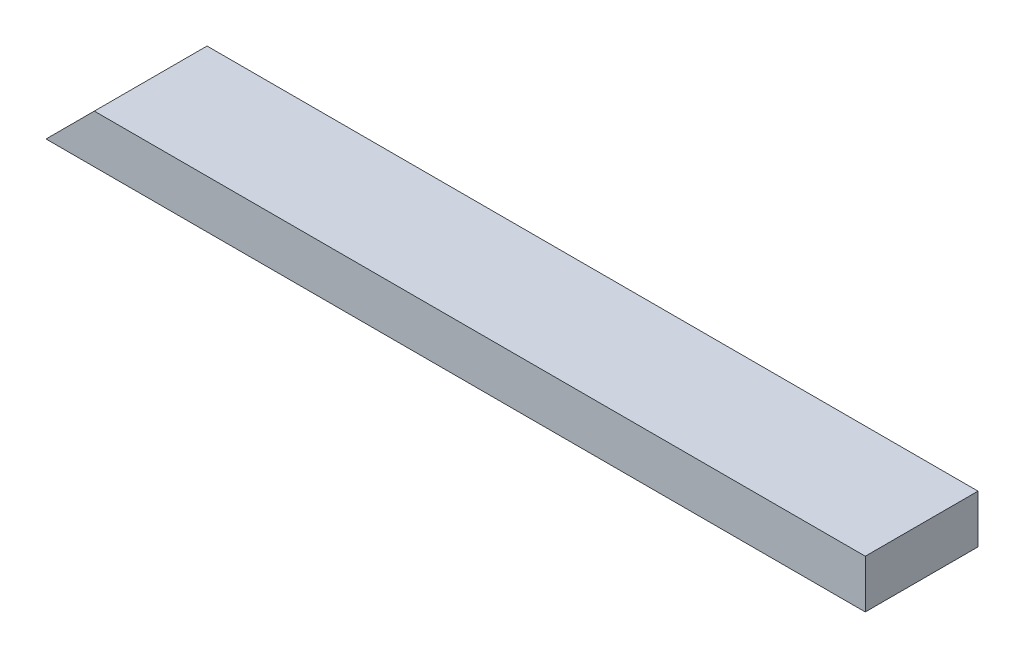
ISO-10303-21;
HEADER;
FILE_DESCRIPTION(('STEP AP214'),'2;1');
FILE_NAME('part.step','',(''),(''),'','','');
FILE_SCHEMA(('AUTOMOTIVE_DESIGN { 1 0 10303 214 1 1 1 1 }'));
ENDSEC;
DATA;
#1=APPLICATION_CONTEXT('core data for automotive mechanical design processes');
#2=APPLICATION_PROTOCOL_DEFINITION('international standard','automotive_design',2000,#1);
#3=PRODUCT_CONTEXT('',#1,'mechanical');
#4=PRODUCT('Part','Part','',(#3));
#5=PRODUCT_RELATED_PRODUCT_CATEGORY('part','',(#4));
#6=PRODUCT_DEFINITION_FORMATION('','',#4);
#7=PRODUCT_DEFINITION_CONTEXT('part definition',#1,'design');
#8=PRODUCT_DEFINITION('design','',#6,#7);
#9=PRODUCT_DEFINITION_SHAPE('','',#8);
#10=(LENGTH_UNIT() NAMED_UNIT(*) SI_UNIT(.MILLI.,.METRE.));
#11=(NAMED_UNIT(*) PLANE_ANGLE_UNIT() SI_UNIT($,.RADIAN.));
#12=(NAMED_UNIT(*) SI_UNIT($,.STERADIAN.) SOLID_ANGLE_UNIT());
#13=UNCERTAINTY_MEASURE_WITH_UNIT(LENGTH_MEASURE(1.E-05),#10,'distance_accuracy_value','');
#14=(GEOMETRIC_REPRESENTATION_CONTEXT(3) GLOBAL_UNCERTAINTY_ASSIGNED_CONTEXT((#13)) GLOBAL_UNIT_ASSIGNED_CONTEXT((#10,
#11,#12)) REPRESENTATION_CONTEXT('',''));
#15=CARTESIAN_POINT('',(0.,0.,0.));
#16=DIRECTION('',(0.,0.,1.));
#17=DIRECTION('',(1.,0.,0.));
#18=AXIS2_PLACEMENT_3D('',#15,#16,#17);
#19=CARTESIAN_POINT('',(0.,38.1,0.));
#20=DIRECTION('',(0.,0.,-1.));
#21=DIRECTION('',(-1.,0.,0.));
#22=AXIS2_PLACEMENT_3D('',#19,#20,#21);
#23=PLANE('',#22);
#24=DIRECTION('',(1.,0.,0.));
#25=VECTOR('',#24,1.);
#26=CARTESIAN_POINT('',(0.,38.1,0.));
#27=LINE('',#26,#25);
#28=CARTESIAN_POINT('',(38.1,38.1,0.));
#29=VERTEX_POINT('',#28);
#30=CARTESIAN_POINT('',(646.1125,38.1,0.));
#31=VERTEX_POINT('',#30);
#32=EDGE_CURVE('E93',#29,#31,#27,.T.);
#33=ORIENTED_EDGE('',*,*,#32,.F.);
#34=DIRECTION('',(0.707106781186547,0.707106781186547,0.));
#35=VECTOR('',#34,1.);
#36=CARTESIAN_POINT('',(0.,0.,0.));
#37=LINE('',#36,#35);
#38=CARTESIAN_POINT('',(0.,0.,0.));
#39=VERTEX_POINT('',#38);
#40=EDGE_CURVE('E87',#39,#29,#37,.T.);
#41=ORIENTED_EDGE('',*,*,#40,.F.);
#42=DIRECTION('',(1.,0.,0.));
#43=VECTOR('',#42,1.);
#44=CARTESIAN_POINT('',(0.,0.,0.));
#45=LINE('',#44,#43);
#46=CARTESIAN_POINT('',(646.1125,0.,0.));
#47=VERTEX_POINT('',#46);
#48=EDGE_CURVE('E97',#39,#47,#45,.T.);
#49=ORIENTED_EDGE('',*,*,#48,.T.);
#50=DIRECTION('',(0.,-1.,0.));
#51=VECTOR('',#50,1.);
#52=CARTESIAN_POINT('',(646.1125,38.1,0.));
#53=LINE('',#52,#51);
#54=EDGE_CURVE('E11',#31,#47,#53,.T.);
#55=ORIENTED_EDGE('',*,*,#54,.F.);
#56=EDGE_LOOP('',(#33,#41,#49,#55));
#57=FACE_BOUND('',#56,.T.);
#58=ADVANCED_FACE('F40',(#57),#23,.F.);
#59=CARTESIAN_POINT('',(646.1125,38.1,0.));
#60=DIRECTION('',(-1.,0.,0.));
#61=DIRECTION('',(0.,0.,1.));
#62=AXIS2_PLACEMENT_3D('',#59,#60,#61);
#63=PLANE('',#62);
#64=DIRECTION('',(0.,0.,-1.));
#65=VECTOR('',#64,1.);
#66=CARTESIAN_POINT('',(646.1125,0.,0.));
#67=LINE('',#66,#65);
#68=CARTESIAN_POINT('',(646.1125,0.,-88.9));
#69=VERTEX_POINT('',#68);
#70=EDGE_CURVE('E68',#47,#69,#67,.T.);
#71=ORIENTED_EDGE('',*,*,#70,.T.);
#72=DIRECTION('',(0.,-1.,0.));
#73=VECTOR('',#72,1.);
#74=CARTESIAN_POINT('',(646.1125,38.1,-88.9));
#75=LINE('',#74,#73);
#76=CARTESIAN_POINT('',(646.1125,38.1,-88.9));
#77=VERTEX_POINT('',#76);
#78=EDGE_CURVE('E48',#77,#69,#75,.T.);
#79=ORIENTED_EDGE('',*,*,#78,.F.);
#80=DIRECTION('',(0.,0.,-1.));
#81=VECTOR('',#80,1.);
#82=CARTESIAN_POINT('',(646.1125,38.1,0.));
#83=LINE('',#82,#81);
#84=EDGE_CURVE('E56',#31,#77,#83,.T.);
#85=ORIENTED_EDGE('',*,*,#84,.F.);
#86=ORIENTED_EDGE('',*,*,#54,.T.);
#87=EDGE_LOOP('',(#71,#79,#85,#86));
#88=FACE_BOUND('',#87,.T.);
#89=ADVANCED_FACE('F112',(#88),#63,.F.);
#90=CARTESIAN_POINT('',(0.,38.1,-88.9));
#91=DIRECTION('',(0.,0.,1.));
#92=DIRECTION('',(1.,0.,0.));
#93=AXIS2_PLACEMENT_3D('',#90,#91,#92);
#94=PLANE('',#93);
#95=DIRECTION('',(-1.,0.,0.));
#96=VECTOR('',#95,1.);
#97=CARTESIAN_POINT('',(0.,0.,-88.9));
#98=LINE('',#97,#96);
#99=CARTESIAN_POINT('',(0.,0.,-88.9));
#100=VERTEX_POINT('',#99);
#101=EDGE_CURVE('E90',#69,#100,#98,.T.);
#102=ORIENTED_EDGE('',*,*,#101,.T.);
#103=DIRECTION('',(0.707106781186547,0.707106781186547,0.));
#104=VECTOR('',#103,1.);
#105=CARTESIAN_POINT('',(0.,0.,-88.9));
#106=LINE('',#105,#104);
#107=CARTESIAN_POINT('',(38.1,38.1,-88.9));
#108=VERTEX_POINT('',#107);
#109=EDGE_CURVE('E75',#100,#108,#106,.T.);
#110=ORIENTED_EDGE('',*,*,#109,.T.);
#111=DIRECTION('',(-1.,0.,0.));
#112=VECTOR('',#111,1.);
#113=CARTESIAN_POINT('',(0.,38.1,-88.9));
#114=LINE('',#113,#112);
#115=EDGE_CURVE('E102',#77,#108,#114,.T.);
#116=ORIENTED_EDGE('',*,*,#115,.F.);
#117=ORIENTED_EDGE('',*,*,#78,.T.);
#118=EDGE_LOOP('',(#102,#110,#116,#117));
#119=FACE_BOUND('',#118,.T.);
#120=ADVANCED_FACE('F91',(#119),#94,.F.);
#121=CARTESIAN_POINT('',(0.,38.1,0.));
#122=DIRECTION('',(0.,-1.,0.));
#123=DIRECTION('',(0.,0.,-1.));
#124=AXIS2_PLACEMENT_3D('',#121,#122,#123);
#125=PLANE('',#124);
#126=ORIENTED_EDGE('',*,*,#115,.T.);
#127=DIRECTION('',(0.,0.,1.));
#128=VECTOR('',#127,1.);
#129=CARTESIAN_POINT('',(38.1,38.1,-88.9));
#130=LINE('',#129,#128);
#131=EDGE_CURVE('E84',#108,#29,#130,.T.);
#132=ORIENTED_EDGE('',*,*,#131,.T.);
#133=ORIENTED_EDGE('',*,*,#32,.T.);
#134=ORIENTED_EDGE('',*,*,#84,.T.);
#135=EDGE_LOOP('',(#126,#132,#133,#134));
#136=FACE_BOUND('',#135,.T.);
#137=ADVANCED_FACE('F110',(#136),#125,.F.);
#138=CARTESIAN_POINT('',(0.,0.,0.));
#139=DIRECTION('',(0.,-1.,0.));
#140=DIRECTION('',(0.,0.,-1.));
#141=AXIS2_PLACEMENT_3D('',#138,#139,#140);
#142=PLANE('',#141);
#143=DIRECTION('',(0.,0.,1.));
#144=VECTOR('',#143,1.);
#145=CARTESIAN_POINT('',(0.,0.,0.));
#146=LINE('',#145,#144);
#147=EDGE_CURVE('E81',#100,#39,#146,.T.);
#148=ORIENTED_EDGE('',*,*,#147,.F.);
#149=ORIENTED_EDGE('',*,*,#101,.F.);
#150=ORIENTED_EDGE('',*,*,#70,.F.);
#151=ORIENTED_EDGE('',*,*,#48,.F.);
#152=EDGE_LOOP('',(#148,#149,#150,#151));
#153=FACE_BOUND('',#152,.T.);
#154=ADVANCED_FACE('F96',(#153),#142,.T.);
#155=CARTESIAN_POINT('',(0.,0.,-88.9));
#156=DIRECTION('',(0.707106781186547,-0.707106781186547,0.));
#157=DIRECTION('',(0.707106781186548,0.707106781186548,0.));
#158=AXIS2_PLACEMENT_3D('',#155,#156,#157);
#159=PLANE('',#158);
#160=ORIENTED_EDGE('',*,*,#40,.T.);
#161=ORIENTED_EDGE('',*,*,#131,.F.);
#162=ORIENTED_EDGE('',*,*,#109,.F.);
#163=ORIENTED_EDGE('',*,*,#147,.T.);
#164=EDGE_LOOP('',(#160,#161,#162,#163));
#165=FACE_BOUND('',#164,.T.);
#166=ADVANCED_FACE('F78',(#165),#159,.F.);
#167=CLOSED_SHELL('',(#58,#89,#120,#137,#154,#166));
#168=MANIFOLD_SOLID_BREP('B2',#167);
#169=ADVANCED_BREP_SHAPE_REPRESENTATION('',(#18,#168),#14);
#170=SHAPE_DEFINITION_REPRESENTATION(#9,#169);
ENDSEC;
END-ISO-10303-21;
